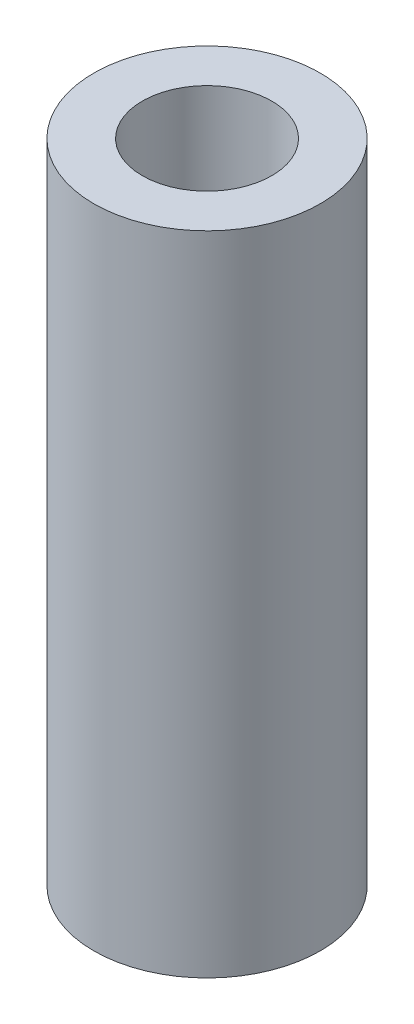
ISO-10303-21;
HEADER;
FILE_DESCRIPTION(('STEP AP214'),'2;1');
FILE_NAME('part.step','',(''),(''),'','','');
FILE_SCHEMA(('AUTOMOTIVE_DESIGN { 1 0 10303 214 1 1 1 1 }'));
ENDSEC;
DATA;
#1=APPLICATION_CONTEXT('core data for automotive mechanical design processes');
#2=APPLICATION_PROTOCOL_DEFINITION('international standard','automotive_design',2000,#1);
#3=PRODUCT_CONTEXT('',#1,'mechanical');
#4=PRODUCT('Part','Part','',(#3));
#5=PRODUCT_RELATED_PRODUCT_CATEGORY('part','',(#4));
#6=PRODUCT_DEFINITION_FORMATION('','',#4);
#7=PRODUCT_DEFINITION_CONTEXT('part definition',#1,'design');
#8=PRODUCT_DEFINITION('design','',#6,#7);
#9=PRODUCT_DEFINITION_SHAPE('','',#8);
#10=(LENGTH_UNIT() NAMED_UNIT(*) SI_UNIT(.MILLI.,.METRE.));
#11=(NAMED_UNIT(*) PLANE_ANGLE_UNIT() SI_UNIT($,.RADIAN.));
#12=(NAMED_UNIT(*) SI_UNIT($,.STERADIAN.) SOLID_ANGLE_UNIT());
#13=UNCERTAINTY_MEASURE_WITH_UNIT(LENGTH_MEASURE(1.E-05),#10,'distance_accuracy_value','');
#14=(GEOMETRIC_REPRESENTATION_CONTEXT(3) GLOBAL_UNCERTAINTY_ASSIGNED_CONTEXT((#13)) GLOBAL_UNIT_ASSIGNED_CONTEXT((#10,
#11,#12)) REPRESENTATION_CONTEXT('',''));
#15=CARTESIAN_POINT('',(0.,0.,0.));
#16=DIRECTION('',(0.,0.,1.));
#17=DIRECTION('',(1.,0.,0.));
#18=AXIS2_PLACEMENT_3D('',#15,#16,#17);
#19=CARTESIAN_POINT('',(0.,400.,0.));
#20=DIRECTION('',(0.,1.,0.));
#21=DIRECTION('',(0.,0.,1.));
#22=AXIS2_PLACEMENT_3D('',#19,#20,#21);
#23=PLANE('',#22);
#24=CARTESIAN_POINT('',(0.,400.,0.));
#25=DIRECTION('',(0.,1.,0.));
#26=DIRECTION('',(0.,0.,1.));
#27=AXIS2_PLACEMENT_3D('',#24,#25,#26);
#28=CIRCLE('',#27,70.);
#29=CARTESIAN_POINT('',(0.,400.,70.));
#30=VERTEX_POINT('',#29);
#31=EDGE_CURVE('E10',#30,#30,#28,.T.);
#32=ORIENTED_EDGE('',*,*,#31,.T.);
#33=EDGE_LOOP('',(#32));
#34=FACE_BOUND('',#33,.T.);
#35=CARTESIAN_POINT('',(0.,400.,0.));
#36=DIRECTION('',(0.,1.,0.));
#37=DIRECTION('',(0.,0.,1.));
#38=AXIS2_PLACEMENT_3D('',#35,#36,#37);
#39=CIRCLE('',#38,40.);
#40=CARTESIAN_POINT('',(0.,400.,40.));
#41=VERTEX_POINT('',#40);
#42=EDGE_CURVE('E53',#41,#41,#39,.T.);
#43=ORIENTED_EDGE('',*,*,#42,.F.);
#44=EDGE_LOOP('',(#43));
#45=FACE_BOUND('',#44,.T.);
#46=ADVANCED_FACE('F40',(#34,#45),#23,.T.);
#47=CARTESIAN_POINT('',(0.,0.,0.));
#48=DIRECTION('',(0.,1.,0.));
#49=DIRECTION('',(0.,0.,1.));
#50=AXIS2_PLACEMENT_3D('',#47,#48,#49);
#51=PLANE('',#50);
#52=CARTESIAN_POINT('',(0.,0.,0.));
#53=DIRECTION('',(0.,1.,0.));
#54=DIRECTION('',(0.,0.,1.));
#55=AXIS2_PLACEMENT_3D('',#52,#53,#54);
#56=CIRCLE('',#55,70.);
#57=CARTESIAN_POINT('',(0.,0.,70.));
#58=VERTEX_POINT('',#57);
#59=EDGE_CURVE('E44',#58,#58,#56,.T.);
#60=ORIENTED_EDGE('',*,*,#59,.F.);
#61=EDGE_LOOP('',(#60));
#62=FACE_BOUND('',#61,.T.);
#63=CARTESIAN_POINT('',(0.,0.,0.));
#64=DIRECTION('',(0.,1.,0.));
#65=DIRECTION('',(0.,0.,1.));
#66=AXIS2_PLACEMENT_3D('',#63,#64,#65);
#67=CIRCLE('',#66,40.);
#68=CARTESIAN_POINT('',(0.,0.,40.));
#69=VERTEX_POINT('',#68);
#70=EDGE_CURVE('E55',#69,#69,#67,.T.);
#71=ORIENTED_EDGE('',*,*,#70,.T.);
#72=EDGE_LOOP('',(#71));
#73=FACE_BOUND('',#72,.T.);
#74=ADVANCED_FACE('F67',(#62,#73),#51,.F.);
#75=CARTESIAN_POINT('',(0.,400.,0.));
#76=DIRECTION('',(0.,-1.,0.));
#77=DIRECTION('',(0.,0.,-1.));
#78=AXIS2_PLACEMENT_3D('',#75,#76,#77);
#79=CYLINDRICAL_SURFACE('',#78,70.);
#80=ORIENTED_EDGE('',*,*,#31,.F.);
#81=EDGE_LOOP('',(#80));
#82=FACE_BOUND('',#81,.T.);
#83=ORIENTED_EDGE('',*,*,#59,.T.);
#84=EDGE_LOOP('',(#83));
#85=FACE_BOUND('',#84,.T.);
#86=ADVANCED_FACE('F42',(#82,#85),#79,.T.);
#87=CARTESIAN_POINT('',(0.,400.,0.));
#88=DIRECTION('',(0.,-1.,0.));
#89=DIRECTION('',(0.,0.,-1.));
#90=AXIS2_PLACEMENT_3D('',#87,#88,#89);
#91=CYLINDRICAL_SURFACE('',#90,40.);
#92=ORIENTED_EDGE('',*,*,#42,.T.);
#93=EDGE_LOOP('',(#92));
#94=FACE_BOUND('',#93,.T.);
#95=ORIENTED_EDGE('',*,*,#70,.F.);
#96=EDGE_LOOP('',(#95));
#97=FACE_BOUND('',#96,.T.);
#98=ADVANCED_FACE('F63',(#94,#97),#91,.F.);
#99=CLOSED_SHELL('',(#46,#74,#86,#98));
#100=MANIFOLD_SOLID_BREP('B2',#99);
#101=ADVANCED_BREP_SHAPE_REPRESENTATION('',(#18,#100),#14);
#102=SHAPE_DEFINITION_REPRESENTATION(#9,#101);
ENDSEC;
END-ISO-10303-21;
